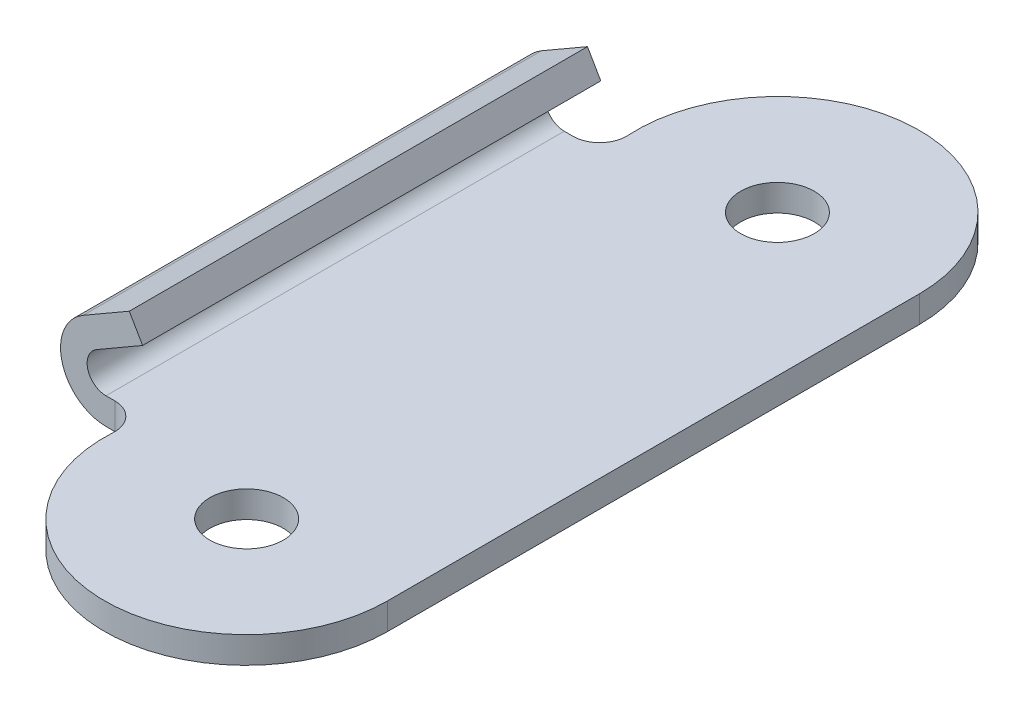
ISO-10303-21;
HEADER;
FILE_DESCRIPTION(('STEP AP214'),'2;1');
FILE_NAME('part.step','',(''),(''),'','','');
FILE_SCHEMA(('AUTOMOTIVE_DESIGN { 1 0 10303 214 1 1 1 1 }'));
ENDSEC;
DATA;
#1=APPLICATION_CONTEXT('core data for automotive mechanical design processes');
#2=APPLICATION_PROTOCOL_DEFINITION('international standard','automotive_design',2000,#1);
#3=PRODUCT_CONTEXT('',#1,'mechanical');
#4=PRODUCT('Part','Part','',(#3));
#5=PRODUCT_RELATED_PRODUCT_CATEGORY('part','',(#4));
#6=PRODUCT_DEFINITION_FORMATION('','',#4);
#7=PRODUCT_DEFINITION_CONTEXT('part definition',#1,'design');
#8=PRODUCT_DEFINITION('design','',#6,#7);
#9=PRODUCT_DEFINITION_SHAPE('','',#8);
#10=(LENGTH_UNIT() NAMED_UNIT(*) SI_UNIT(.MILLI.,.METRE.));
#11=(NAMED_UNIT(*) PLANE_ANGLE_UNIT() SI_UNIT($,.RADIAN.));
#12=(NAMED_UNIT(*) SI_UNIT($,.STERADIAN.) SOLID_ANGLE_UNIT());
#13=UNCERTAINTY_MEASURE_WITH_UNIT(LENGTH_MEASURE(1.E-05),#10,'distance_accuracy_value','');
#14=(GEOMETRIC_REPRESENTATION_CONTEXT(3) GLOBAL_UNCERTAINTY_ASSIGNED_CONTEXT((#13)) GLOBAL_UNIT_ASSIGNED_CONTEXT((#10,
#11,#12)) REPRESENTATION_CONTEXT('',''));
#15=CARTESIAN_POINT('',(0.,0.,0.));
#16=DIRECTION('',(0.,0.,1.));
#17=DIRECTION('',(1.,0.,0.));
#18=AXIS2_PLACEMENT_3D('',#15,#16,#17);
#19=CARTESIAN_POINT('',(-8.96085445703785,2.61791345841873,18.288));
#20=DIRECTION('',(-0.499999999999995,0.866025403784441,0.));
#21=DIRECTION('',(-0.866025403784441,-0.499999999999995,0.));
#22=AXIS2_PLACEMENT_3D('',#19,#20,#21);
#23=PLANE('',#22);
#24=DIRECTION('',(0.,0.,-1.));
#25=VECTOR('',#24,1.);
#26=CARTESIAN_POINT('',(-8.96085445703785,2.61791345841873,18.288));
#27=LINE('',#26,#25);
#28=CARTESIAN_POINT('',(-8.96085445703785,2.61791345841873,10.2832712288799));
#29=VERTEX_POINT('',#28);
#30=CARTESIAN_POINT('',(-8.96085445703785,2.61791345841873,-10.2832712288798));
#31=VERTEX_POINT('',#30);
#32=EDGE_CURVE('E117',#29,#31,#27,.T.);
#33=ORIENTED_EDGE('',*,*,#32,.F.);
#34=DIRECTION('',(-0.866025403784441,-0.499999999999995,0.));
#35=VECTOR('',#34,1.);
#36=CARTESIAN_POINT('',(-6.89609999999999,3.81,10.2832712288799));
#37=LINE('',#36,#35);
#38=CARTESIAN_POINT('',(-6.89609999999999,3.81,10.2832712288799));
#39=VERTEX_POINT('',#38);
#40=EDGE_CURVE('E194',#39,#29,#37,.T.);
#41=ORIENTED_EDGE('',*,*,#40,.F.);
#42=DIRECTION('',(0.,0.,1.));
#43=VECTOR('',#42,1.);
#44=CARTESIAN_POINT('',(-6.89609999999999,3.81,18.288));
#45=LINE('',#44,#43);
#46=CARTESIAN_POINT('',(-6.8961,3.81,-10.2832712288798));
#47=VERTEX_POINT('',#46);
#48=EDGE_CURVE('E140',#47,#39,#45,.T.);
#49=ORIENTED_EDGE('',*,*,#48,.F.);
#50=DIRECTION('',(0.866025403784441,0.499999999999996,0.));
#51=VECTOR('',#50,1.);
#52=CARTESIAN_POINT('',(-8.96085445703785,2.61791345841873,-10.2832712288798));
#53=LINE('',#52,#51);
#54=EDGE_CURVE('E145',#31,#47,#53,.T.);
#55=ORIENTED_EDGE('',*,*,#54,.F.);
#56=EDGE_LOOP('',(#33,#41,#49,#55));
#57=FACE_BOUND('',#56,.T.);
#58=ADVANCED_FACE('F15',(#57),#23,.T.);
#59=CARTESIAN_POINT('',(-6.89609999999999,3.81,18.288));
#60=DIRECTION('',(0.866025403784442,0.499999999999995,0.));
#61=DIRECTION('',(-0.499999999999995,0.866025403784442,0.));
#62=AXIS2_PLACEMENT_3D('',#59,#60,#61);
#63=PLANE('',#62);
#64=DIRECTION('',(-0.499999999999987,0.866025403784446,0.));
#65=VECTOR('',#64,1.);
#66=CARTESIAN_POINT('',(-6.29920000000001,2.77613887296213,10.2832712288799));
#67=LINE('',#66,#65);
#68=CARTESIAN_POINT('',(-6.29920000000001,2.77613887296213,10.2832712288799));
#69=VERTEX_POINT('',#68);
#70=EDGE_CURVE('E142',#69,#39,#67,.T.);
#71=ORIENTED_EDGE('',*,*,#70,.F.);
#72=DIRECTION('',(0.,0.,1.));
#73=VECTOR('',#72,1.);
#74=CARTESIAN_POINT('',(-6.29920000000001,2.77613887296213,18.288));
#75=LINE('',#74,#73);
#76=CARTESIAN_POINT('',(-6.29920000000001,2.77613887296213,-10.2832712288798));
#77=VERTEX_POINT('',#76);
#78=EDGE_CURVE('E188',#69,#77,#75,.F.);
#79=ORIENTED_EDGE('',*,*,#78,.T.);
#80=DIRECTION('',(0.499999999999996,-0.866025403784441,0.));
#81=VECTOR('',#80,1.);
#82=CARTESIAN_POINT('',(-6.89610000000001,3.80999999999999,-10.2832712288798));
#83=LINE('',#82,#81);
#84=EDGE_CURVE('E99',#47,#77,#83,.T.);
#85=ORIENTED_EDGE('',*,*,#84,.F.);
#86=ORIENTED_EDGE('',*,*,#48,.T.);
#87=EDGE_LOOP('',(#71,#79,#85,#86));
#88=FACE_BOUND('',#87,.T.);
#89=ADVANCED_FACE('F362',(#88),#63,.T.);
#90=CARTESIAN_POINT('',(-7.58482962117816,3.811,10.2832712288799));
#91=DIRECTION('',(0.,0.,1.));
#92=DIRECTION('',(1.,0.,0.));
#93=AXIS2_PLACEMENT_3D('',#90,#91,#92);
#94=PLANE('',#93);
#95=DIRECTION('',(1.,0.,0.));
#96=VECTOR('',#95,1.);
#97=CARTESIAN_POINT('',(-7.58482962117816,0.,10.2832712288799));
#98=LINE('',#97,#96);
#99=CARTESIAN_POINT('',(-7.54787821882966,0.,10.2832712288799));
#100=VERTEX_POINT('',#99);
#101=CARTESIAN_POINT('',(-7.93950891407572,0.,10.2832712288799));
#102=VERTEX_POINT('',#101);
#103=EDGE_CURVE('E118',#100,#102,#98,.F.);
#104=ORIENTED_EDGE('',*,*,#103,.T.);
#105=CARTESIAN_POINT('',(-7.93950891407572,0.848891085924276,10.2832712288799));
#106=DIRECTION('',(0.,0.,-1.));
#107=DIRECTION('',(-1.,0.,0.));
#108=AXIS2_PLACEMENT_3D('',#105,#106,#107);
#109=CIRCLE('',#108,0.848891085924277);
#110=CARTESIAN_POINT('',(-8.36395445703786,1.58405233138086,10.2832712288799));
#111=VERTEX_POINT('',#110);
#112=EDGE_CURVE('E18',#102,#111,#109,.T.);
#113=ORIENTED_EDGE('',*,*,#112,.T.);
#114=DIRECTION('',(-0.866025403784441,-0.499999999999995,0.));
#115=VECTOR('',#114,1.);
#116=CARTESIAN_POINT('',(-8.36395445703786,1.58405233138086,10.2832712288799));
#117=LINE('',#116,#115);
#118=EDGE_CURVE('E191',#111,#69,#117,.F.);
#119=ORIENTED_EDGE('',*,*,#118,.T.);
#120=ORIENTED_EDGE('',*,*,#70,.T.);
#121=ORIENTED_EDGE('',*,*,#40,.T.);
#122=CARTESIAN_POINT('',(-7.93950891407572,0.848891085924276,10.2832712288799));
#123=DIRECTION('',(0.,0.,-1.));
#124=DIRECTION('',(-1.,0.,0.));
#125=AXIS2_PLACEMENT_3D('',#122,#123,#124);
#126=CIRCLE('',#125,2.04269108592428);
#127=CARTESIAN_POINT('',(-7.93950891407572,-1.1938,10.2832712288799));
#128=VERTEX_POINT('',#127);
#129=EDGE_CURVE('E179',#128,#29,#126,.T.);
#130=ORIENTED_EDGE('',*,*,#129,.F.);
#131=DIRECTION('',(1.,0.,0.));
#132=VECTOR('',#131,1.);
#133=CARTESIAN_POINT('',(-7.58482962117816,-1.1938,10.2832712288799));
#134=LINE('',#133,#132);
#135=CARTESIAN_POINT('',(-7.54787821882966,-1.1938,10.2832712288799));
#136=VERTEX_POINT('',#135);
#137=EDGE_CURVE('E146',#128,#136,#134,.T.);
#138=ORIENTED_EDGE('',*,*,#137,.T.);
#139=DIRECTION('',(0.,1.,0.));
#140=VECTOR('',#139,1.);
#141=CARTESIAN_POINT('',(-7.54787821882966,3.811,10.2832712288799));
#142=LINE('',#141,#140);
#143=EDGE_CURVE('E121',#136,#100,#142,.T.);
#144=ORIENTED_EDGE('',*,*,#143,.T.);
#145=EDGE_LOOP('',(#104,#113,#119,#120,#121,#130,#138,#144));
#146=FACE_BOUND('',#145,.T.);
#147=ADVANCED_FACE('F120',(#146),#94,.T.);
#148=CARTESIAN_POINT('',(-7.58482962117816,3.811,-10.2832712288798));
#149=DIRECTION('',(0.,0.,-1.));
#150=DIRECTION('',(-1.,0.,0.));
#151=AXIS2_PLACEMENT_3D('',#148,#149,#150);
#152=PLANE('',#151);
#153=DIRECTION('',(0.,1.,0.));
#154=VECTOR('',#153,1.);
#155=CARTESIAN_POINT('',(-7.54787821882965,3.811,-10.2832712288798));
#156=LINE('',#155,#154);
#157=CARTESIAN_POINT('',(-7.54787821882965,0.,-10.2832712288798));
#158=VERTEX_POINT('',#157);
#159=CARTESIAN_POINT('',(-7.54787821882965,-1.1938,-10.2832712288798));
#160=VERTEX_POINT('',#159);
#161=EDGE_CURVE('E138',#158,#160,#156,.F.);
#162=ORIENTED_EDGE('',*,*,#161,.T.);
#163=DIRECTION('',(-1.,0.,0.));
#164=VECTOR('',#163,1.);
#165=CARTESIAN_POINT('',(-7.58482962117816,-1.1938,-10.2832712288798));
#166=LINE('',#165,#164);
#167=CARTESIAN_POINT('',(-7.93950891407572,-1.1938,-10.2832712288798));
#168=VERTEX_POINT('',#167);
#169=EDGE_CURVE('E192',#160,#168,#166,.T.);
#170=ORIENTED_EDGE('',*,*,#169,.T.);
#171=CARTESIAN_POINT('',(-7.93950891407572,0.848891085924276,-10.2832712288798));
#172=DIRECTION('',(0.,0.,-1.));
#173=DIRECTION('',(-1.,0.,0.));
#174=AXIS2_PLACEMENT_3D('',#171,#172,#173);
#175=CIRCLE('',#174,2.04269108592428);
#176=EDGE_CURVE('E176',#31,#168,#175,.F.);
#177=ORIENTED_EDGE('',*,*,#176,.F.);
#178=ORIENTED_EDGE('',*,*,#54,.T.);
#179=ORIENTED_EDGE('',*,*,#84,.T.);
#180=DIRECTION('',(-0.866025403784441,-0.499999999999995,0.));
#181=VECTOR('',#180,1.);
#182=CARTESIAN_POINT('',(-8.36395445703786,1.58405233138086,-10.2832712288798));
#183=LINE('',#182,#181);
#184=CARTESIAN_POINT('',(-8.36395445703786,1.58405233138086,-10.2832712288798));
#185=VERTEX_POINT('',#184);
#186=EDGE_CURVE('E180',#77,#185,#183,.T.);
#187=ORIENTED_EDGE('',*,*,#186,.T.);
#188=CARTESIAN_POINT('',(-7.93950891407572,0.848891085924276,-10.2832712288798));
#189=DIRECTION('',(0.,0.,-1.));
#190=DIRECTION('',(-1.,0.,0.));
#191=AXIS2_PLACEMENT_3D('',#188,#189,#190);
#192=CIRCLE('',#191,0.848891085924277);
#193=CARTESIAN_POINT('',(-7.93950891407572,0.,-10.2832712288798));
#194=VERTEX_POINT('',#193);
#195=EDGE_CURVE('E181',#185,#194,#192,.F.);
#196=ORIENTED_EDGE('',*,*,#195,.T.);
#197=DIRECTION('',(-1.,0.,0.));
#198=VECTOR('',#197,1.);
#199=CARTESIAN_POINT('',(-7.58482962117816,0.,-10.2832712288798));
#200=LINE('',#199,#198);
#201=EDGE_CURVE('E127',#194,#158,#200,.F.);
#202=ORIENTED_EDGE('',*,*,#201,.T.);
#203=EDGE_LOOP('',(#162,#170,#177,#178,#179,#187,#196,#202));
#204=FACE_BOUND('',#203,.T.);
#205=ADVANCED_FACE('F202',(#204),#152,.T.);
#206=CARTESIAN_POINT('',(-8.36395445703786,1.58405233138086,18.288));
#207=DIRECTION('',(-0.499999999999995,0.866025403784441,0.));
#208=DIRECTION('',(-0.866025403784441,-0.499999999999995,0.));
#209=AXIS2_PLACEMENT_3D('',#206,#207,#208);
#210=PLANE('',#209);
#211=ORIENTED_EDGE('',*,*,#78,.F.);
#212=ORIENTED_EDGE('',*,*,#118,.F.);
#213=DIRECTION('',(0.,0.,-1.));
#214=VECTOR('',#213,1.);
#215=CARTESIAN_POINT('',(-8.36395445703786,1.58405233138086,18.288));
#216=LINE('',#215,#214);
#217=EDGE_CURVE('E116',#111,#185,#216,.T.);
#218=ORIENTED_EDGE('',*,*,#217,.T.);
#219=ORIENTED_EDGE('',*,*,#186,.F.);
#220=EDGE_LOOP('',(#211,#212,#218,#219));
#221=FACE_BOUND('',#220,.T.);
#222=ADVANCED_FACE('F205',(#221),#210,.F.);
#223=CARTESIAN_POINT('',(-7.93950891407572,0.848891085924276,18.288));
#224=DIRECTION('',(0.,0.,-1.));
#225=DIRECTION('',(-1.,0.,0.));
#226=AXIS2_PLACEMENT_3D('',#223,#224,#225);
#227=CYLINDRICAL_SURFACE('',#226,2.04269108592428);
#228=ORIENTED_EDGE('',*,*,#176,.T.);
#229=DIRECTION('',(0.,0.,1.));
#230=VECTOR('',#229,1.);
#231=CARTESIAN_POINT('',(-7.93950891407572,-1.1938,18.288));
#232=LINE('',#231,#230);
#233=EDGE_CURVE('E175',#128,#168,#232,.F.);
#234=ORIENTED_EDGE('',*,*,#233,.F.);
#235=ORIENTED_EDGE('',*,*,#129,.T.);
#236=ORIENTED_EDGE('',*,*,#32,.T.);
#237=EDGE_LOOP('',(#228,#234,#235,#236));
#238=FACE_BOUND('',#237,.T.);
#239=ADVANCED_FACE('F328',(#238),#227,.T.);
#240=CARTESIAN_POINT('',(6.35,-1.1938,18.288));
#241=DIRECTION('',(0.,-1.,0.));
#242=DIRECTION('',(1.,0.,0.));
#243=AXIS2_PLACEMENT_3D('',#240,#241,#242);
#244=PLANE('',#243);
#245=DIRECTION('',(0.,0.,-1.));
#246=VECTOR('',#245,1.);
#247=CARTESIAN_POINT('',(6.35,-1.1938,18.288));
#248=LINE('',#247,#246);
#249=CARTESIAN_POINT('',(6.35,-1.1938,11.9323811531687));
#250=VERTEX_POINT('',#249);
#251=CARTESIAN_POINT('',(6.35,-1.1938,-11.9323811531687));
#252=VERTEX_POINT('',#251);
#253=EDGE_CURVE('E165',#250,#252,#248,.T.);
#254=ORIENTED_EDGE('',*,*,#253,.F.);
#255=CARTESIAN_POINT('',(-0.00561884683128265,-1.1938,11.9323811531687));
#256=DIRECTION('',(0.,-1.,0.));
#257=DIRECTION('',(1.,0.,0.));
#258=AXIS2_PLACEMENT_3D('',#255,#256,#257);
#259=CIRCLE('',#258,6.35561884683128);
#260=CARTESIAN_POINT('',(-6.35,-1.1938,11.5545998546446));
#261=VERTEX_POINT('',#260);
#262=EDGE_CURVE('E158',#261,#250,#259,.F.);
#263=ORIENTED_EDGE('',*,*,#262,.F.);
#264=CARTESIAN_POINT('',(-7.54787821882966,-1.1938,11.4832712288799));
#265=DIRECTION('',(0.,-1.,0.));
#266=DIRECTION('',(1.,0.,0.));
#267=AXIS2_PLACEMENT_3D('',#264,#265,#266);
#268=CIRCLE('',#267,1.2);
#269=EDGE_CURVE('E155',#261,#136,#268,.F.);
#270=ORIENTED_EDGE('',*,*,#269,.T.);
#271=ORIENTED_EDGE('',*,*,#137,.F.);
#272=ORIENTED_EDGE('',*,*,#233,.T.);
#273=ORIENTED_EDGE('',*,*,#169,.F.);
#274=CARTESIAN_POINT('',(-7.54787821882965,-1.1938,-11.4832712288798));
#275=DIRECTION('',(0.,-1.,0.));
#276=DIRECTION('',(1.,0.,0.));
#277=AXIS2_PLACEMENT_3D('',#274,#275,#276);
#278=CIRCLE('',#277,1.2);
#279=CARTESIAN_POINT('',(-6.35,-1.1938,-11.5545998546445));
#280=VERTEX_POINT('',#279);
#281=EDGE_CURVE('E167',#160,#280,#278,.F.);
#282=ORIENTED_EDGE('',*,*,#281,.T.);
#283=CARTESIAN_POINT('',(-0.00561884683128265,-1.1938,-11.9323811531687));
#284=DIRECTION('',(0.,-1.,0.));
#285=DIRECTION('',(1.,0.,0.));
#286=AXIS2_PLACEMENT_3D('',#283,#284,#285);
#287=CIRCLE('',#286,6.35561884683128);
#288=EDGE_CURVE('E162',#252,#280,#287,.F.);
#289=ORIENTED_EDGE('',*,*,#288,.F.);
#290=EDGE_LOOP('',(#254,#263,#270,#271,#272,#273,#282,#289));
#291=FACE_BOUND('',#290,.T.);
#292=CARTESIAN_POINT('',(0.,-1.1938,-11.9126));
#293=DIRECTION('',(0.,1.,0.));
#294=DIRECTION('',(-1.,0.,0.));
#295=AXIS2_PLACEMENT_3D('',#292,#293,#294);
#296=CIRCLE('',#295,1.651);
#297=CARTESIAN_POINT('',(-1.651,-1.1938,-11.9126));
#298=VERTEX_POINT('',#297);
#299=EDGE_CURVE('E169',#298,#298,#296,.T.);
#300=ORIENTED_EDGE('',*,*,#299,.T.);
#301=EDGE_LOOP('',(#300));
#302=FACE_BOUND('',#301,.T.);
#303=CARTESIAN_POINT('',(0.,-1.1938,11.9126));
#304=DIRECTION('',(0.,1.,0.));
#305=DIRECTION('',(-1.,0.,0.));
#306=AXIS2_PLACEMENT_3D('',#303,#304,#305);
#307=CIRCLE('',#306,1.651);
#308=CARTESIAN_POINT('',(-1.651,-1.1938,11.9126));
#309=VERTEX_POINT('',#308);
#310=EDGE_CURVE('E172',#309,#309,#307,.T.);
#311=ORIENTED_EDGE('',*,*,#310,.T.);
#312=EDGE_LOOP('',(#311));
#313=FACE_BOUND('',#312,.T.);
#314=ADVANCED_FACE('F235',(#291,#302,#313),#244,.T.);
#315=CARTESIAN_POINT('',(0.,-1.1948,11.9126));
#316=DIRECTION('',(0.,1.,0.));
#317=DIRECTION('',(-1.,0.,0.));
#318=AXIS2_PLACEMENT_3D('',#315,#316,#317);
#319=CYLINDRICAL_SURFACE('',#318,1.651);
#320=ORIENTED_EDGE('',*,*,#310,.F.);
#321=EDGE_LOOP('',(#320));
#322=FACE_BOUND('',#321,.T.);
#323=CARTESIAN_POINT('',(0.,0.,11.9126));
#324=DIRECTION('',(0.,1.,0.));
#325=DIRECTION('',(-1.,0.,0.));
#326=AXIS2_PLACEMENT_3D('',#323,#324,#325);
#327=CIRCLE('',#326,1.651);
#328=CARTESIAN_POINT('',(-1.651,0.,11.9126));
#329=VERTEX_POINT('',#328);
#330=EDGE_CURVE('E134',#329,#329,#327,.T.);
#331=ORIENTED_EDGE('',*,*,#330,.T.);
#332=EDGE_LOOP('',(#331));
#333=FACE_BOUND('',#332,.T.);
#334=ADVANCED_FACE('F309',(#322,#333),#319,.F.);
#335=CARTESIAN_POINT('',(0.,-1.1948,-11.9126));
#336=DIRECTION('',(0.,1.,0.));
#337=DIRECTION('',(-1.,0.,0.));
#338=AXIS2_PLACEMENT_3D('',#335,#336,#337);
#339=CYLINDRICAL_SURFACE('',#338,1.651);
#340=ORIENTED_EDGE('',*,*,#299,.F.);
#341=EDGE_LOOP('',(#340));
#342=FACE_BOUND('',#341,.T.);
#343=CARTESIAN_POINT('',(0.,0.,-11.9126));
#344=DIRECTION('',(0.,1.,0.));
#345=DIRECTION('',(-1.,0.,0.));
#346=AXIS2_PLACEMENT_3D('',#343,#344,#345);
#347=CIRCLE('',#346,1.651);
#348=CARTESIAN_POINT('',(-1.651,0.,-11.9126));
#349=VERTEX_POINT('',#348);
#350=EDGE_CURVE('E129',#349,#349,#347,.T.);
#351=ORIENTED_EDGE('',*,*,#350,.T.);
#352=EDGE_LOOP('',(#351));
#353=FACE_BOUND('',#352,.T.);
#354=ADVANCED_FACE('F300',(#342,#353),#339,.F.);
#355=CARTESIAN_POINT('',(-7.93950891407572,0.848891085924276,18.288));
#356=DIRECTION('',(0.,0.,-1.));
#357=DIRECTION('',(-1.,0.,0.));
#358=AXIS2_PLACEMENT_3D('',#355,#356,#357);
#359=CYLINDRICAL_SURFACE('',#358,0.848891085924277);
#360=ORIENTED_EDGE('',*,*,#112,.F.);
#361=DIRECTION('',(0.,0.,1.));
#362=VECTOR('',#361,1.);
#363=CARTESIAN_POINT('',(-7.93950891407572,0.,18.288));
#364=LINE('',#363,#362);
#365=EDGE_CURVE('E113',#102,#194,#364,.F.);
#366=ORIENTED_EDGE('',*,*,#365,.T.);
#367=ORIENTED_EDGE('',*,*,#195,.F.);
#368=ORIENTED_EDGE('',*,*,#217,.F.);
#369=EDGE_LOOP('',(#360,#366,#367,#368));
#370=FACE_BOUND('',#369,.T.);
#371=ADVANCED_FACE('F111',(#370),#359,.F.);
#372=CARTESIAN_POINT('',(-7.54787821882965,3.811,-11.4832712288798));
#373=DIRECTION('',(0.,-1.,0.));
#374=DIRECTION('',(1.,0.,0.));
#375=AXIS2_PLACEMENT_3D('',#372,#373,#374);
#376=CYLINDRICAL_SURFACE('',#375,1.2);
#377=CARTESIAN_POINT('',(-7.54787821882965,0.,-11.4832712288798));
#378=DIRECTION('',(0.,-1.,0.));
#379=DIRECTION('',(1.,0.,0.));
#380=AXIS2_PLACEMENT_3D('',#377,#378,#379);
#381=CIRCLE('',#380,1.2);
#382=CARTESIAN_POINT('',(-6.35,0.,-11.5545998546445));
#383=VERTEX_POINT('',#382);
#384=EDGE_CURVE('E128',#158,#383,#381,.F.);
#385=ORIENTED_EDGE('',*,*,#384,.T.);
#386=DIRECTION('',(0.,-1.,0.));
#387=VECTOR('',#386,1.);
#388=CARTESIAN_POINT('',(-6.35,3.811,-11.5545998546445));
#389=LINE('',#388,#387);
#390=EDGE_CURVE('E166',#280,#383,#389,.F.);
#391=ORIENTED_EDGE('',*,*,#390,.F.);
#392=ORIENTED_EDGE('',*,*,#281,.F.);
#393=ORIENTED_EDGE('',*,*,#161,.F.);
#394=EDGE_LOOP('',(#385,#391,#392,#393));
#395=FACE_BOUND('',#394,.T.);
#396=ADVANCED_FACE('F233',(#395),#376,.F.);
#397=CARTESIAN_POINT('',(-0.00561884683128334,3.811,-11.9323811531687));
#398=DIRECTION('',(0.,-1.,0.));
#399=DIRECTION('',(1.,0.,0.));
#400=AXIS2_PLACEMENT_3D('',#397,#398,#399);
#401=CYLINDRICAL_SURFACE('',#400,6.35561884683128);
#402=DIRECTION('',(0.,1.,0.));
#403=VECTOR('',#402,1.);
#404=CARTESIAN_POINT('',(6.35,0.,-11.9323811531687));
#405=LINE('',#404,#403);
#406=CARTESIAN_POINT('',(6.35,0.,-11.9323811531687));
#407=VERTEX_POINT('',#406);
#408=EDGE_CURVE('E214',#252,#407,#405,.T.);
#409=ORIENTED_EDGE('',*,*,#408,.F.);
#410=ORIENTED_EDGE('',*,*,#288,.T.);
#411=ORIENTED_EDGE('',*,*,#390,.T.);
#412=CARTESIAN_POINT('',(-0.00561884683128282,0.,-11.9323811531687));
#413=DIRECTION('',(0.,-1.,0.));
#414=DIRECTION('',(1.,0.,0.));
#415=AXIS2_PLACEMENT_3D('',#412,#413,#414);
#416=CIRCLE('',#415,6.35561884683128);
#417=EDGE_CURVE('E131',#383,#407,#416,.T.);
#418=ORIENTED_EDGE('',*,*,#417,.T.);
#419=EDGE_LOOP('',(#409,#410,#411,#418));
#420=FACE_BOUND('',#419,.T.);
#421=ADVANCED_FACE('F229',(#420),#401,.T.);
#422=CARTESIAN_POINT('',(6.35,0.,18.288));
#423=DIRECTION('',(1.,0.,0.));
#424=DIRECTION('',(0.,0.,-1.));
#425=AXIS2_PLACEMENT_3D('',#422,#423,#424);
#426=PLANE('',#425);
#427=ORIENTED_EDGE('',*,*,#253,.T.);
#428=ORIENTED_EDGE('',*,*,#408,.T.);
#429=DIRECTION('',(0.,0.,1.));
#430=VECTOR('',#429,1.);
#431=CARTESIAN_POINT('',(6.35,0.,18.288));
#432=LINE('',#431,#430);
#433=CARTESIAN_POINT('',(6.35,0.,11.9323811531687));
#434=VERTEX_POINT('',#433);
#435=EDGE_CURVE('E150',#407,#434,#432,.T.);
#436=ORIENTED_EDGE('',*,*,#435,.T.);
#437=DIRECTION('',(0.,-1.,0.));
#438=VECTOR('',#437,1.);
#439=CARTESIAN_POINT('',(6.35,3.811,11.9323811531687));
#440=LINE('',#439,#438);
#441=EDGE_CURVE('E161',#250,#434,#440,.F.);
#442=ORIENTED_EDGE('',*,*,#441,.F.);
#443=EDGE_LOOP('',(#427,#428,#436,#442));
#444=FACE_BOUND('',#443,.T.);
#445=ADVANCED_FACE('F224',(#444),#426,.T.);
#446=CARTESIAN_POINT('',(-0.00561884683128334,3.811,11.9323811531687));
#447=DIRECTION('',(0.,-1.,0.));
#448=DIRECTION('',(1.,0.,0.));
#449=AXIS2_PLACEMENT_3D('',#446,#447,#448);
#450=CYLINDRICAL_SURFACE('',#449,6.35561884683128);
#451=DIRECTION('',(0.,-1.,0.));
#452=VECTOR('',#451,1.);
#453=CARTESIAN_POINT('',(-6.35,3.811,11.5545998546446));
#454=LINE('',#453,#452);
#455=CARTESIAN_POINT('',(-6.35,0.,11.5545998546446));
#456=VERTEX_POINT('',#455);
#457=EDGE_CURVE('E32',#456,#261,#454,.T.);
#458=ORIENTED_EDGE('',*,*,#457,.T.);
#459=ORIENTED_EDGE('',*,*,#262,.T.);
#460=ORIENTED_EDGE('',*,*,#441,.T.);
#461=CARTESIAN_POINT('',(-0.00561884683128282,0.,11.9323811531687));
#462=DIRECTION('',(0.,-1.,0.));
#463=DIRECTION('',(1.,0.,0.));
#464=AXIS2_PLACEMENT_3D('',#461,#462,#463);
#465=CIRCLE('',#464,6.35561884683128);
#466=EDGE_CURVE('E24',#434,#456,#465,.T.);
#467=ORIENTED_EDGE('',*,*,#466,.T.);
#468=EDGE_LOOP('',(#458,#459,#460,#467));
#469=FACE_BOUND('',#468,.T.);
#470=ADVANCED_FACE('F239',(#469),#450,.T.);
#471=CARTESIAN_POINT('',(-7.54787821882966,3.811,11.4832712288799));
#472=DIRECTION('',(0.,-1.,0.));
#473=DIRECTION('',(1.,0.,0.));
#474=AXIS2_PLACEMENT_3D('',#471,#472,#473);
#475=CYLINDRICAL_SURFACE('',#474,1.2);
#476=CARTESIAN_POINT('',(-7.54787821882966,0.,11.4832712288799));
#477=DIRECTION('',(0.,-1.,0.));
#478=DIRECTION('',(1.,0.,0.));
#479=AXIS2_PLACEMENT_3D('',#476,#477,#478);
#480=CIRCLE('',#479,1.2);
#481=EDGE_CURVE('E9',#456,#100,#480,.F.);
#482=ORIENTED_EDGE('',*,*,#481,.T.);
#483=ORIENTED_EDGE('',*,*,#143,.F.);
#484=ORIENTED_EDGE('',*,*,#269,.F.);
#485=ORIENTED_EDGE('',*,*,#457,.F.);
#486=EDGE_LOOP('',(#482,#483,#484,#485));
#487=FACE_BOUND('',#486,.T.);
#488=ADVANCED_FACE('F241',(#487),#475,.F.);
#489=CARTESIAN_POINT('',(6.35,0.,18.288));
#490=DIRECTION('',(0.,-1.,0.));
#491=DIRECTION('',(1.,0.,0.));
#492=AXIS2_PLACEMENT_3D('',#489,#490,#491);
#493=PLANE('',#492);
#494=ORIENTED_EDGE('',*,*,#103,.F.);
#495=ORIENTED_EDGE('',*,*,#481,.F.);
#496=ORIENTED_EDGE('',*,*,#466,.F.);
#497=ORIENTED_EDGE('',*,*,#435,.F.);
#498=ORIENTED_EDGE('',*,*,#417,.F.);
#499=ORIENTED_EDGE('',*,*,#384,.F.);
#500=ORIENTED_EDGE('',*,*,#201,.F.);
#501=ORIENTED_EDGE('',*,*,#365,.F.);
#502=EDGE_LOOP('',(#494,#495,#496,#497,#498,#499,#500,#501));
#503=FACE_BOUND('',#502,.T.);
#504=ORIENTED_EDGE('',*,*,#350,.F.);
#505=EDGE_LOOP('',(#504));
#506=FACE_BOUND('',#505,.T.);
#507=ORIENTED_EDGE('',*,*,#330,.F.);
#508=EDGE_LOOP('',(#507));
#509=FACE_BOUND('',#508,.T.);
#510=ADVANCED_FACE('F124',(#503,#506,#509),#493,.F.);
#511=CLOSED_SHELL('',(#58,#89,#147,#205,#222,#239,#314,#334,#354,#371,#396,#421,#445,#470,#488,#510));
#512=MANIFOLD_SOLID_BREP('B1',#511);
#513=ADVANCED_BREP_SHAPE_REPRESENTATION('',(#18,#512),#14);
#514=SHAPE_DEFINITION_REPRESENTATION(#9,#513);
ENDSEC;
END-ISO-10303-21;
